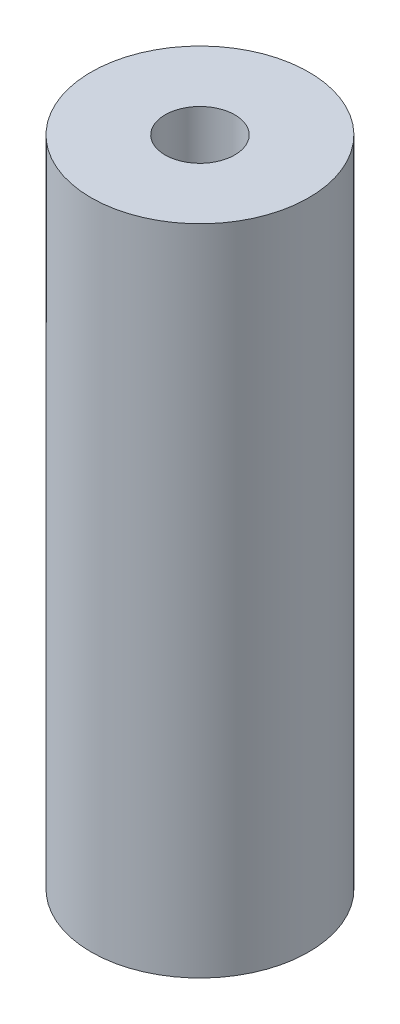
ISO-10303-21;
HEADER;
FILE_DESCRIPTION(('STEP AP214'),'2;1');
FILE_NAME('part.step','',(''),(''),'','','');
FILE_SCHEMA(('AUTOMOTIVE_DESIGN { 1 0 10303 214 1 1 1 1 }'));
ENDSEC;
DATA;
#1=APPLICATION_CONTEXT('core data for automotive mechanical design processes');
#2=APPLICATION_PROTOCOL_DEFINITION('international standard','automotive_design',2000,#1);
#3=PRODUCT_CONTEXT('',#1,'mechanical');
#4=PRODUCT('Part','Part','',(#3));
#5=PRODUCT_RELATED_PRODUCT_CATEGORY('part','',(#4));
#6=PRODUCT_DEFINITION_FORMATION('','',#4);
#7=PRODUCT_DEFINITION_CONTEXT('part definition',#1,'design');
#8=PRODUCT_DEFINITION('design','',#6,#7);
#9=PRODUCT_DEFINITION_SHAPE('','',#8);
#10=(LENGTH_UNIT() NAMED_UNIT(*) SI_UNIT(.MILLI.,.METRE.));
#11=(NAMED_UNIT(*) PLANE_ANGLE_UNIT() SI_UNIT($,.RADIAN.));
#12=(NAMED_UNIT(*) SI_UNIT($,.STERADIAN.) SOLID_ANGLE_UNIT());
#13=UNCERTAINTY_MEASURE_WITH_UNIT(LENGTH_MEASURE(1.E-05),#10,'distance_accuracy_value','');
#14=(GEOMETRIC_REPRESENTATION_CONTEXT(3) GLOBAL_UNCERTAINTY_ASSIGNED_CONTEXT((#13)) GLOBAL_UNIT_ASSIGNED_CONTEXT((#10,
#11,#12)) REPRESENTATION_CONTEXT('',''));
#15=CARTESIAN_POINT('',(0.,0.,0.));
#16=DIRECTION('',(0.,0.,1.));
#17=DIRECTION('',(1.,0.,0.));
#18=AXIS2_PLACEMENT_3D('',#15,#16,#17);
#19=CARTESIAN_POINT('',(0.,76.2,0.));
#20=DIRECTION('',(0.,1.,0.));
#21=DIRECTION('',(0.,0.,1.));
#22=AXIS2_PLACEMENT_3D('',#19,#20,#21);
#23=PLANE('',#22);
#24=CARTESIAN_POINT('',(0.,76.2,0.));
#25=DIRECTION('',(0.,1.,0.));
#26=DIRECTION('',(0.,0.,1.));
#27=AXIS2_PLACEMENT_3D('',#24,#25,#26);
#28=CIRCLE('',#27,12.7);
#29=CARTESIAN_POINT('',(0.,76.2,12.7));
#30=VERTEX_POINT('',#29);
#31=EDGE_CURVE('E10',#30,#30,#28,.T.);
#32=ORIENTED_EDGE('',*,*,#31,.T.);
#33=EDGE_LOOP('',(#32));
#34=FACE_BOUND('',#33,.T.);
#35=CARTESIAN_POINT('',(0.,76.2,0.));
#36=DIRECTION('',(0.,1.,0.));
#37=DIRECTION('',(0.,0.,1.));
#38=AXIS2_PLACEMENT_3D('',#35,#36,#37);
#39=CIRCLE('',#38,4.064);
#40=CARTESIAN_POINT('',(0.,76.2,4.064));
#41=VERTEX_POINT('',#40);
#42=EDGE_CURVE('E42',#41,#41,#39,.T.);
#43=ORIENTED_EDGE('',*,*,#42,.F.);
#44=EDGE_LOOP('',(#43));
#45=FACE_BOUND('',#44,.T.);
#46=ADVANCED_FACE('F31',(#34,#45),#23,.T.);
#47=CARTESIAN_POINT('',(0.,0.,0.));
#48=DIRECTION('',(0.,1.,0.));
#49=DIRECTION('',(0.,0.,1.));
#50=AXIS2_PLACEMENT_3D('',#47,#48,#49);
#51=PLANE('',#50);
#52=CARTESIAN_POINT('',(0.,0.,0.));
#53=DIRECTION('',(0.,1.,0.));
#54=DIRECTION('',(0.,0.,1.));
#55=AXIS2_PLACEMENT_3D('',#52,#53,#54);
#56=CIRCLE('',#55,12.7);
#57=CARTESIAN_POINT('',(0.,0.,12.7));
#58=VERTEX_POINT('',#57);
#59=EDGE_CURVE('E35',#58,#58,#56,.T.);
#60=ORIENTED_EDGE('',*,*,#59,.F.);
#61=EDGE_LOOP('',(#60));
#62=FACE_BOUND('',#61,.T.);
#63=CARTESIAN_POINT('',(0.,0.,0.));
#64=DIRECTION('',(0.,1.,0.));
#65=DIRECTION('',(0.,0.,1.));
#66=AXIS2_PLACEMENT_3D('',#63,#64,#65);
#67=CIRCLE('',#66,4.064);
#68=CARTESIAN_POINT('',(0.,0.,4.064));
#69=VERTEX_POINT('',#68);
#70=EDGE_CURVE('E44',#69,#69,#67,.T.);
#71=ORIENTED_EDGE('',*,*,#70,.T.);
#72=EDGE_LOOP('',(#71));
#73=FACE_BOUND('',#72,.T.);
#74=ADVANCED_FACE('F54',(#62,#73),#51,.F.);
#75=CARTESIAN_POINT('',(0.,76.2,0.));
#76=DIRECTION('',(0.,-1.,0.));
#77=DIRECTION('',(0.,0.,-1.));
#78=AXIS2_PLACEMENT_3D('',#75,#76,#77);
#79=CYLINDRICAL_SURFACE('',#78,12.7);
#80=ORIENTED_EDGE('',*,*,#31,.F.);
#81=EDGE_LOOP('',(#80));
#82=FACE_BOUND('',#81,.T.);
#83=ORIENTED_EDGE('',*,*,#59,.T.);
#84=EDGE_LOOP('',(#83));
#85=FACE_BOUND('',#84,.T.);
#86=ADVANCED_FACE('F33',(#82,#85),#79,.T.);
#87=CARTESIAN_POINT('',(0.,76.2,0.));
#88=DIRECTION('',(0.,-1.,0.));
#89=DIRECTION('',(0.,0.,-1.));
#90=AXIS2_PLACEMENT_3D('',#87,#88,#89);
#91=CYLINDRICAL_SURFACE('',#90,4.064);
#92=ORIENTED_EDGE('',*,*,#42,.T.);
#93=EDGE_LOOP('',(#92));
#94=FACE_BOUND('',#93,.T.);
#95=ORIENTED_EDGE('',*,*,#70,.F.);
#96=EDGE_LOOP('',(#95));
#97=FACE_BOUND('',#96,.T.);
#98=ADVANCED_FACE('F50',(#94,#97),#91,.F.);
#99=CLOSED_SHELL('',(#46,#74,#86,#98));
#100=MANIFOLD_SOLID_BREP('B2',#99);
#101=ADVANCED_BREP_SHAPE_REPRESENTATION('',(#18,#100),#14);
#102=SHAPE_DEFINITION_REPRESENTATION(#9,#101);
ENDSEC;
END-ISO-10303-21;
